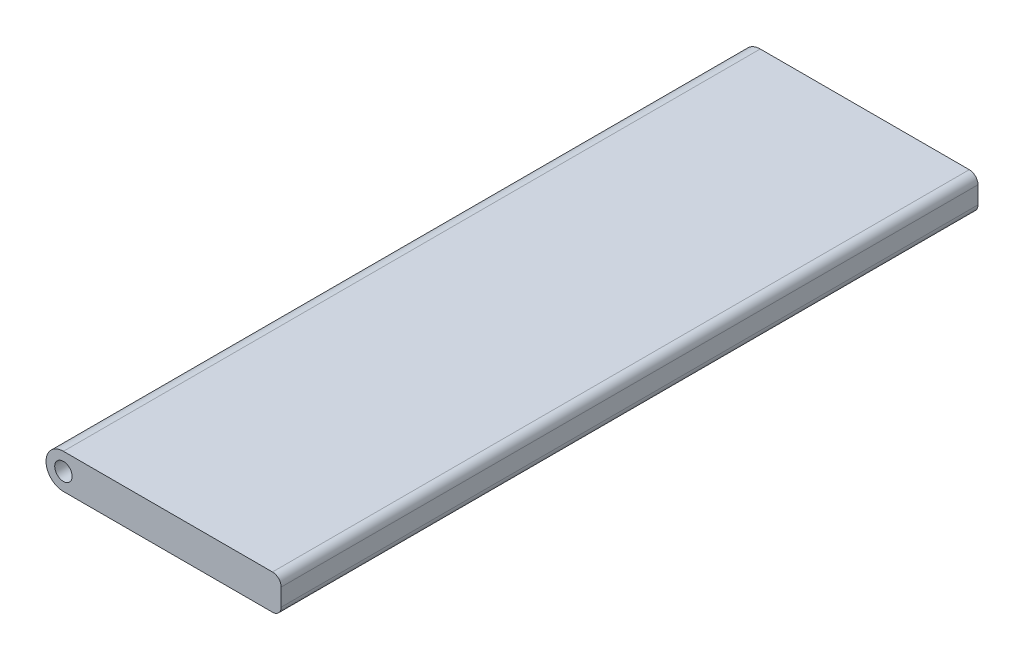
ISO-10303-21;
HEADER;
FILE_DESCRIPTION(('STEP AP214'),'2;1');
FILE_NAME('part.step','',(''),(''),'','','');
FILE_SCHEMA(('AUTOMOTIVE_DESIGN { 1 0 10303 214 1 1 1 1 }'));
ENDSEC;
DATA;
#1=APPLICATION_CONTEXT('core data for automotive mechanical design processes');
#2=APPLICATION_PROTOCOL_DEFINITION('international standard','automotive_design',2000,#1);
#3=PRODUCT_CONTEXT('',#1,'mechanical');
#4=PRODUCT('Part','Part','',(#3));
#5=PRODUCT_RELATED_PRODUCT_CATEGORY('part','',(#4));
#6=PRODUCT_DEFINITION_FORMATION('','',#4);
#7=PRODUCT_DEFINITION_CONTEXT('part definition',#1,'design');
#8=PRODUCT_DEFINITION('design','',#6,#7);
#9=PRODUCT_DEFINITION_SHAPE('','',#8);
#10=(LENGTH_UNIT() NAMED_UNIT(*) SI_UNIT(.MILLI.,.METRE.));
#11=(NAMED_UNIT(*) PLANE_ANGLE_UNIT() SI_UNIT($,.RADIAN.));
#12=(NAMED_UNIT(*) SI_UNIT($,.STERADIAN.) SOLID_ANGLE_UNIT());
#13=UNCERTAINTY_MEASURE_WITH_UNIT(LENGTH_MEASURE(1.E-05),#10,'distance_accuracy_value','');
#14=(GEOMETRIC_REPRESENTATION_CONTEXT(3) GLOBAL_UNCERTAINTY_ASSIGNED_CONTEXT((#13)) GLOBAL_UNIT_ASSIGNED_CONTEXT((#10,
#11,#12)) REPRESENTATION_CONTEXT('',''));
#15=CARTESIAN_POINT('',(0.,0.,0.));
#16=DIRECTION('',(0.,0.,1.));
#17=DIRECTION('',(1.,0.,0.));
#18=AXIS2_PLACEMENT_3D('',#15,#16,#17);
#19=CARTESIAN_POINT('',(0.,0.,80.));
#20=DIRECTION('',(0.,0.,-1.));
#21=DIRECTION('',(-1.,0.,0.));
#22=AXIS2_PLACEMENT_3D('',#19,#20,#21);
#23=CYLINDRICAL_SURFACE('',#22,2.);
#24=CARTESIAN_POINT('',(0.,0.,0.));
#25=DIRECTION('',(0.,0.,1.));
#26=DIRECTION('',(1.,0.,0.));
#27=AXIS2_PLACEMENT_3D('',#24,#25,#26);
#28=CIRCLE('',#27,2.);
#29=CARTESIAN_POINT('',(0.,2.,0.));
#30=VERTEX_POINT('',#29);
#31=CARTESIAN_POINT('',(0.,-2.,0.));
#32=VERTEX_POINT('',#31);
#33=EDGE_CURVE('E124',#30,#32,#28,.T.);
#34=ORIENTED_EDGE('',*,*,#33,.T.);
#35=DIRECTION('',(0.,0.,-1.));
#36=VECTOR('',#35,1.);
#37=CARTESIAN_POINT('',(0.,-2.,80.));
#38=LINE('',#37,#36);
#39=CARTESIAN_POINT('',(0.,-2.,80.));
#40=VERTEX_POINT('',#39);
#41=EDGE_CURVE('E11',#40,#32,#38,.T.);
#42=ORIENTED_EDGE('',*,*,#41,.F.);
#43=CARTESIAN_POINT('',(0.,0.,80.));
#44=DIRECTION('',(0.,0.,1.));
#45=DIRECTION('',(1.,0.,0.));
#46=AXIS2_PLACEMENT_3D('',#43,#44,#45);
#47=CIRCLE('',#46,2.);
#48=CARTESIAN_POINT('',(0.,2.,80.));
#49=VERTEX_POINT('',#48);
#50=EDGE_CURVE('E139',#49,#40,#47,.T.);
#51=ORIENTED_EDGE('',*,*,#50,.F.);
#52=DIRECTION('',(0.,0.,-1.));
#53=VECTOR('',#52,1.);
#54=CARTESIAN_POINT('',(0.,2.,80.));
#55=LINE('',#54,#53);
#56=EDGE_CURVE('E51',#49,#30,#55,.T.);
#57=ORIENTED_EDGE('',*,*,#56,.T.);
#58=EDGE_LOOP('',(#34,#42,#51,#57));
#59=FACE_BOUND('',#58,.T.);
#60=ADVANCED_FACE('F35',(#59),#23,.T.);
#61=CARTESIAN_POINT('',(0.,-2.,80.));
#62=DIRECTION('',(0.,1.,0.));
#63=DIRECTION('',(0.,0.,1.));
#64=AXIS2_PLACEMENT_3D('',#61,#62,#63);
#65=PLANE('',#64);
#66=DIRECTION('',(1.,0.,0.));
#67=VECTOR('',#66,1.);
#68=CARTESIAN_POINT('',(0.,-2.,0.));
#69=LINE('',#68,#67);
#70=CARTESIAN_POINT('',(24.,-2.,0.));
#71=VERTEX_POINT('',#70);
#72=EDGE_CURVE('E126',#32,#71,#69,.T.);
#73=ORIENTED_EDGE('',*,*,#72,.T.);
#74=DIRECTION('',(0.,0.,-1.));
#75=VECTOR('',#74,1.);
#76=CARTESIAN_POINT('',(24.,-2.,80.));
#77=LINE('',#76,#75);
#78=CARTESIAN_POINT('',(24.,-2.,80.));
#79=VERTEX_POINT('',#78);
#80=EDGE_CURVE('E43',#79,#71,#77,.T.);
#81=ORIENTED_EDGE('',*,*,#80,.F.);
#82=DIRECTION('',(1.,0.,0.));
#83=VECTOR('',#82,1.);
#84=CARTESIAN_POINT('',(0.,-2.,80.));
#85=LINE('',#84,#83);
#86=EDGE_CURVE('E83',#40,#79,#85,.T.);
#87=ORIENTED_EDGE('',*,*,#86,.F.);
#88=ORIENTED_EDGE('',*,*,#41,.T.);
#89=EDGE_LOOP('',(#73,#81,#87,#88));
#90=FACE_BOUND('',#89,.T.);
#91=ADVANCED_FACE('F161',(#90),#65,.F.);
#92=CARTESIAN_POINT('',(24.,-1.,80.));
#93=DIRECTION('',(0.,0.,-1.));
#94=DIRECTION('',(-1.,0.,0.));
#95=AXIS2_PLACEMENT_3D('',#92,#93,#94);
#96=CYLINDRICAL_SURFACE('',#95,1.);
#97=CARTESIAN_POINT('',(24.,-1.,0.));
#98=DIRECTION('',(0.,0.,1.));
#99=DIRECTION('',(1.,0.,0.));
#100=AXIS2_PLACEMENT_3D('',#97,#98,#99);
#101=CIRCLE('',#100,1.);
#102=CARTESIAN_POINT('',(25.,-1.,0.));
#103=VERTEX_POINT('',#102);
#104=EDGE_CURVE('E128',#71,#103,#101,.T.);
#105=ORIENTED_EDGE('',*,*,#104,.T.);
#106=DIRECTION('',(0.,0.,-1.));
#107=VECTOR('',#106,1.);
#108=CARTESIAN_POINT('',(25.,-1.,80.));
#109=LINE('',#108,#107);
#110=CARTESIAN_POINT('',(25.,-1.,80.));
#111=VERTEX_POINT('',#110);
#112=EDGE_CURVE('E113',#111,#103,#109,.T.);
#113=ORIENTED_EDGE('',*,*,#112,.F.);
#114=CARTESIAN_POINT('',(24.,-1.,80.));
#115=DIRECTION('',(0.,0.,1.));
#116=DIRECTION('',(1.,0.,0.));
#117=AXIS2_PLACEMENT_3D('',#114,#115,#116);
#118=CIRCLE('',#117,1.);
#119=EDGE_CURVE('E101',#79,#111,#118,.T.);
#120=ORIENTED_EDGE('',*,*,#119,.F.);
#121=ORIENTED_EDGE('',*,*,#80,.T.);
#122=EDGE_LOOP('',(#105,#113,#120,#121));
#123=FACE_BOUND('',#122,.T.);
#124=ADVANCED_FACE('F145',(#123),#96,.T.);
#125=CARTESIAN_POINT('',(25.,0.,80.));
#126=DIRECTION('',(-1.,0.,0.));
#127=DIRECTION('',(0.,0.,1.));
#128=AXIS2_PLACEMENT_3D('',#125,#126,#127);
#129=PLANE('',#128);
#130=DIRECTION('',(0.,1.,0.));
#131=VECTOR('',#130,1.);
#132=CARTESIAN_POINT('',(25.,0.,0.));
#133=LINE('',#132,#131);
#134=CARTESIAN_POINT('',(25.,1.,0.));
#135=VERTEX_POINT('',#134);
#136=EDGE_CURVE('E110',#103,#135,#133,.T.);
#137=ORIENTED_EDGE('',*,*,#136,.T.);
#138=DIRECTION('',(0.,0.,-1.));
#139=VECTOR('',#138,1.);
#140=CARTESIAN_POINT('',(25.,1.,80.));
#141=LINE('',#140,#139);
#142=CARTESIAN_POINT('',(25.,1.,80.));
#143=VERTEX_POINT('',#142);
#144=EDGE_CURVE('E107',#143,#135,#141,.T.);
#145=ORIENTED_EDGE('',*,*,#144,.F.);
#146=DIRECTION('',(0.,1.,0.));
#147=VECTOR('',#146,1.);
#148=CARTESIAN_POINT('',(25.,0.,80.));
#149=LINE('',#148,#147);
#150=EDGE_CURVE('E93',#111,#143,#149,.T.);
#151=ORIENTED_EDGE('',*,*,#150,.F.);
#152=ORIENTED_EDGE('',*,*,#112,.T.);
#153=EDGE_LOOP('',(#137,#145,#151,#152));
#154=FACE_BOUND('',#153,.T.);
#155=ADVANCED_FACE('F108',(#154),#129,.F.);
#156=CARTESIAN_POINT('',(24.,1.,80.));
#157=DIRECTION('',(0.,0.,-1.));
#158=DIRECTION('',(-1.,0.,0.));
#159=AXIS2_PLACEMENT_3D('',#156,#157,#158);
#160=CYLINDRICAL_SURFACE('',#159,1.);
#161=CARTESIAN_POINT('',(24.,1.,0.));
#162=DIRECTION('',(0.,0.,1.));
#163=DIRECTION('',(1.,0.,0.));
#164=AXIS2_PLACEMENT_3D('',#161,#162,#163);
#165=CIRCLE('',#164,1.);
#166=CARTESIAN_POINT('',(24.,2.,0.));
#167=VERTEX_POINT('',#166);
#168=EDGE_CURVE('E131',#167,#135,#165,.F.);
#169=ORIENTED_EDGE('',*,*,#168,.F.);
#170=DIRECTION('',(0.,0.,-1.));
#171=VECTOR('',#170,1.);
#172=CARTESIAN_POINT('',(24.,2.,80.));
#173=LINE('',#172,#171);
#174=CARTESIAN_POINT('',(24.,2.,80.));
#175=VERTEX_POINT('',#174);
#176=EDGE_CURVE('E71',#175,#167,#173,.T.);
#177=ORIENTED_EDGE('',*,*,#176,.F.);
#178=CARTESIAN_POINT('',(24.,1.,80.));
#179=DIRECTION('',(0.,0.,1.));
#180=DIRECTION('',(1.,0.,0.));
#181=AXIS2_PLACEMENT_3D('',#178,#179,#180);
#182=CIRCLE('',#181,1.);
#183=EDGE_CURVE('E99',#175,#143,#182,.F.);
#184=ORIENTED_EDGE('',*,*,#183,.T.);
#185=ORIENTED_EDGE('',*,*,#144,.T.);
#186=EDGE_LOOP('',(#169,#177,#184,#185));
#187=FACE_BOUND('',#186,.T.);
#188=ADVANCED_FACE('F115',(#187),#160,.T.);
#189=CARTESIAN_POINT('',(0.,2.,80.));
#190=DIRECTION('',(0.,1.,0.));
#191=DIRECTION('',(0.,0.,1.));
#192=AXIS2_PLACEMENT_3D('',#189,#190,#191);
#193=PLANE('',#192);
#194=DIRECTION('',(1.,0.,0.));
#195=VECTOR('',#194,1.);
#196=CARTESIAN_POINT('',(0.,2.,0.));
#197=LINE('',#196,#195);
#198=EDGE_CURVE('E133',#30,#167,#197,.T.);
#199=ORIENTED_EDGE('',*,*,#198,.F.);
#200=ORIENTED_EDGE('',*,*,#56,.F.);
#201=DIRECTION('',(1.,0.,0.));
#202=VECTOR('',#201,1.);
#203=CARTESIAN_POINT('',(0.,2.,80.));
#204=LINE('',#203,#202);
#205=EDGE_CURVE('E116',#49,#175,#204,.T.);
#206=ORIENTED_EDGE('',*,*,#205,.T.);
#207=ORIENTED_EDGE('',*,*,#176,.T.);
#208=EDGE_LOOP('',(#199,#200,#206,#207));
#209=FACE_BOUND('',#208,.T.);
#210=ADVANCED_FACE('F149',(#209),#193,.T.);
#211=CARTESIAN_POINT('',(0.,0.,80.));
#212=DIRECTION('',(0.,0.,-1.));
#213=DIRECTION('',(-1.,0.,0.));
#214=AXIS2_PLACEMENT_3D('',#211,#212,#213);
#215=CYLINDRICAL_SURFACE('',#214,1.);
#216=CARTESIAN_POINT('',(0.,0.,80.));
#217=DIRECTION('',(0.,0.,1.));
#218=DIRECTION('',(1.,0.,0.));
#219=AXIS2_PLACEMENT_3D('',#216,#217,#218);
#220=CIRCLE('',#219,1.);
#221=CARTESIAN_POINT('',(1.,0.,80.));
#222=VERTEX_POINT('',#221);
#223=EDGE_CURVE('E118',#222,#222,#220,.T.);
#224=ORIENTED_EDGE('',*,*,#223,.T.);
#225=EDGE_LOOP('',(#224));
#226=FACE_BOUND('',#225,.T.);
#227=CARTESIAN_POINT('',(0.,0.,0.));
#228=DIRECTION('',(0.,0.,1.));
#229=DIRECTION('',(1.,0.,0.));
#230=AXIS2_PLACEMENT_3D('',#227,#228,#229);
#231=CIRCLE('',#230,1.);
#232=CARTESIAN_POINT('',(1.,0.,0.));
#233=VERTEX_POINT('',#232);
#234=EDGE_CURVE('E136',#233,#233,#231,.T.);
#235=ORIENTED_EDGE('',*,*,#234,.F.);
#236=EDGE_LOOP('',(#235));
#237=FACE_BOUND('',#236,.T.);
#238=ADVANCED_FACE('F151',(#226,#237),#215,.F.);
#239=CARTESIAN_POINT('',(0.,0.,80.));
#240=DIRECTION('',(0.,0.,1.));
#241=DIRECTION('',(1.,0.,0.));
#242=AXIS2_PLACEMENT_3D('',#239,#240,#241);
#243=PLANE('',#242);
#244=ORIENTED_EDGE('',*,*,#50,.T.);
#245=ORIENTED_EDGE('',*,*,#86,.T.);
#246=ORIENTED_EDGE('',*,*,#119,.T.);
#247=ORIENTED_EDGE('',*,*,#150,.T.);
#248=ORIENTED_EDGE('',*,*,#183,.F.);
#249=ORIENTED_EDGE('',*,*,#205,.F.);
#250=EDGE_LOOP('',(#244,#245,#246,#247,#248,#249));
#251=FACE_BOUND('',#250,.T.);
#252=ORIENTED_EDGE('',*,*,#223,.F.);
#253=EDGE_LOOP('',(#252));
#254=FACE_BOUND('',#253,.T.);
#255=ADVANCED_FACE('F95',(#251,#254),#243,.T.);
#256=CARTESIAN_POINT('',(0.,0.,0.));
#257=DIRECTION('',(0.,0.,1.));
#258=DIRECTION('',(1.,0.,0.));
#259=AXIS2_PLACEMENT_3D('',#256,#257,#258);
#260=PLANE('',#259);
#261=ORIENTED_EDGE('',*,*,#33,.F.);
#262=ORIENTED_EDGE('',*,*,#198,.T.);
#263=ORIENTED_EDGE('',*,*,#168,.T.);
#264=ORIENTED_EDGE('',*,*,#136,.F.);
#265=ORIENTED_EDGE('',*,*,#104,.F.);
#266=ORIENTED_EDGE('',*,*,#72,.F.);
#267=EDGE_LOOP('',(#261,#262,#263,#264,#265,#266));
#268=FACE_BOUND('',#267,.T.);
#269=ORIENTED_EDGE('',*,*,#234,.T.);
#270=EDGE_LOOP('',(#269));
#271=FACE_BOUND('',#270,.T.);
#272=ADVANCED_FACE('F147',(#268,#271),#260,.F.);
#273=CLOSED_SHELL('',(#60,#91,#124,#155,#188,#210,#238,#255,#272));
#274=MANIFOLD_SOLID_BREP('B2',#273);
#275=ADVANCED_BREP_SHAPE_REPRESENTATION('',(#18,#274),#14);
#276=SHAPE_DEFINITION_REPRESENTATION(#9,#275);
ENDSEC;
END-ISO-10303-21;
